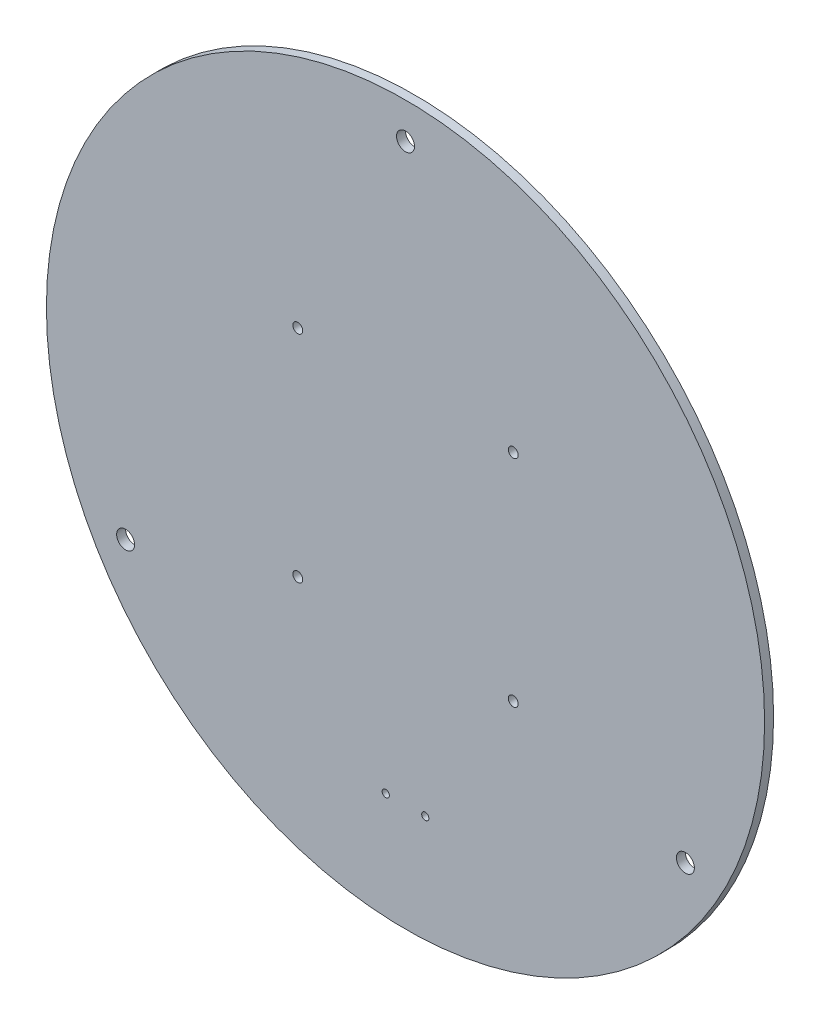
ISO-10303-21;
HEADER;
FILE_DESCRIPTION(('STEP AP214'),'2;1');
FILE_NAME('part.step','',(''),(''),'','','');
FILE_SCHEMA(('AUTOMOTIVE_DESIGN { 1 0 10303 214 1 1 1 1 }'));
ENDSEC;
DATA;
#1=APPLICATION_CONTEXT('core data for automotive mechanical design processes');
#2=APPLICATION_PROTOCOL_DEFINITION('international standard','automotive_design',2000,#1);
#3=PRODUCT_CONTEXT('',#1,'mechanical');
#4=PRODUCT('Part','Part','',(#3));
#5=PRODUCT_RELATED_PRODUCT_CATEGORY('part','',(#4));
#6=PRODUCT_DEFINITION_FORMATION('','',#4);
#7=PRODUCT_DEFINITION_CONTEXT('part definition',#1,'design');
#8=PRODUCT_DEFINITION('design','',#6,#7);
#9=PRODUCT_DEFINITION_SHAPE('','',#8);
#10=(LENGTH_UNIT() NAMED_UNIT(*) SI_UNIT(.MILLI.,.METRE.));
#11=(NAMED_UNIT(*) PLANE_ANGLE_UNIT() SI_UNIT($,.RADIAN.));
#12=(NAMED_UNIT(*) SI_UNIT($,.STERADIAN.) SOLID_ANGLE_UNIT());
#13=UNCERTAINTY_MEASURE_WITH_UNIT(LENGTH_MEASURE(1.E-05),#10,'distance_accuracy_value','');
#14=(GEOMETRIC_REPRESENTATION_CONTEXT(3) GLOBAL_UNCERTAINTY_ASSIGNED_CONTEXT((#13)) GLOBAL_UNIT_ASSIGNED_CONTEXT((#10,
#11,#12)) REPRESENTATION_CONTEXT('',''));
#15=CARTESIAN_POINT('',(0.,0.,0.));
#16=DIRECTION('',(0.,0.,1.));
#17=DIRECTION('',(1.,0.,0.));
#18=AXIS2_PLACEMENT_3D('',#15,#16,#17);
#19=CARTESIAN_POINT('',(0.,0.,5.));
#20=DIRECTION('',(0.,0.,-1.));
#21=DIRECTION('',(-1.,0.,0.));
#22=AXIS2_PLACEMENT_3D('',#19,#20,#21);
#23=CYLINDRICAL_SURFACE('',#22,200.);
#24=CARTESIAN_POINT('',(0.,0.,5.));
#25=DIRECTION('',(0.,0.,1.));
#26=DIRECTION('',(1.,0.,0.));
#27=AXIS2_PLACEMENT_3D('',#24,#25,#26);
#28=CIRCLE('',#27,200.);
#29=CARTESIAN_POINT('',(200.,0.,5.));
#30=VERTEX_POINT('',#29);
#31=EDGE_CURVE('E10',#30,#30,#28,.T.);
#32=ORIENTED_EDGE('',*,*,#31,.F.);
#33=EDGE_LOOP('',(#32));
#34=FACE_BOUND('',#33,.T.);
#35=CARTESIAN_POINT('',(0.,0.,0.));
#36=DIRECTION('',(0.,0.,1.));
#37=DIRECTION('',(1.,0.,0.));
#38=AXIS2_PLACEMENT_3D('',#35,#36,#37);
#39=CIRCLE('',#38,200.);
#40=CARTESIAN_POINT('',(200.,0.,0.));
#41=VERTEX_POINT('',#40);
#42=EDGE_CURVE('E37',#41,#41,#39,.T.);
#43=ORIENTED_EDGE('',*,*,#42,.T.);
#44=EDGE_LOOP('',(#43));
#45=FACE_BOUND('',#44,.T.);
#46=ADVANCED_FACE('F34',(#34,#45),#23,.T.);
#47=CARTESIAN_POINT('',(0.,0.,5.));
#48=DIRECTION('',(0.,0.,1.));
#49=DIRECTION('',(1.,0.,0.));
#50=AXIS2_PLACEMENT_3D('',#47,#48,#49);
#51=PLANE('',#50);
#52=CARTESIAN_POINT('',(11.,-140.,5.));
#53=DIRECTION('',(0.,0.,1.));
#54=DIRECTION('',(1.,0.,0.));
#55=AXIS2_PLACEMENT_3D('',#52,#53,#54);
#56=CIRCLE('',#55,2.);
#57=CARTESIAN_POINT('',(13.,-140.,5.));
#58=VERTEX_POINT('',#57);
#59=EDGE_CURVE('E91',#58,#58,#56,.T.);
#60=ORIENTED_EDGE('',*,*,#59,.F.);
#61=EDGE_LOOP('',(#60));
#62=FACE_BOUND('',#61,.T.);
#63=CARTESIAN_POINT('',(-11.,-140.,5.));
#64=DIRECTION('',(0.,0.,1.));
#65=DIRECTION('',(1.,0.,0.));
#66=AXIS2_PLACEMENT_3D('',#63,#64,#65);
#67=CIRCLE('',#66,2.);
#68=CARTESIAN_POINT('',(-8.99999999999998,-140.,5.));
#69=VERTEX_POINT('',#68);
#70=EDGE_CURVE('E92',#69,#69,#67,.T.);
#71=ORIENTED_EDGE('',*,*,#70,.F.);
#72=EDGE_LOOP('',(#71));
#73=FACE_BOUND('',#72,.T.);
#74=CARTESIAN_POINT('',(-60.,-60.,5.));
#75=DIRECTION('',(0.,0.,1.));
#76=DIRECTION('',(1.,0.,0.));
#77=AXIS2_PLACEMENT_3D('',#74,#75,#76);
#78=CIRCLE('',#77,2.75);
#79=CARTESIAN_POINT('',(-57.25,-60.,5.));
#80=VERTEX_POINT('',#79);
#81=EDGE_CURVE('E74',#80,#80,#78,.T.);
#82=ORIENTED_EDGE('',*,*,#81,.F.);
#83=EDGE_LOOP('',(#82));
#84=FACE_BOUND('',#83,.T.);
#85=CARTESIAN_POINT('',(60.,-60.,5.));
#86=DIRECTION('',(0.,0.,1.));
#87=DIRECTION('',(1.,0.,0.));
#88=AXIS2_PLACEMENT_3D('',#85,#86,#87);
#89=CIRCLE('',#88,2.75);
#90=CARTESIAN_POINT('',(62.75,-60.,5.));
#91=VERTEX_POINT('',#90);
#92=EDGE_CURVE('E73',#91,#91,#89,.T.);
#93=ORIENTED_EDGE('',*,*,#92,.F.);
#94=EDGE_LOOP('',(#93));
#95=FACE_BOUND('',#94,.T.);
#96=CARTESIAN_POINT('',(60.,60.,5.));
#97=DIRECTION('',(0.,0.,1.));
#98=DIRECTION('',(1.,0.,0.));
#99=AXIS2_PLACEMENT_3D('',#96,#97,#98);
#100=CIRCLE('',#99,2.75);
#101=CARTESIAN_POINT('',(62.75,60.,5.));
#102=VERTEX_POINT('',#101);
#103=EDGE_CURVE('E81',#102,#102,#100,.T.);
#104=ORIENTED_EDGE('',*,*,#103,.F.);
#105=EDGE_LOOP('',(#104));
#106=FACE_BOUND('',#105,.T.);
#107=CARTESIAN_POINT('',(-60.,60.,5.));
#108=DIRECTION('',(0.,0.,1.));
#109=DIRECTION('',(1.,0.,0.));
#110=AXIS2_PLACEMENT_3D('',#107,#108,#109);
#111=CIRCLE('',#110,2.75);
#112=CARTESIAN_POINT('',(-57.25,60.,5.));
#113=VERTEX_POINT('',#112);
#114=EDGE_CURVE('E66',#113,#113,#111,.T.);
#115=ORIENTED_EDGE('',*,*,#114,.F.);
#116=EDGE_LOOP('',(#115));
#117=FACE_BOUND('',#116,.T.);
#118=CARTESIAN_POINT('',(0.,180.,5.));
#119=DIRECTION('',(0.,0.,1.));
#120=DIRECTION('',(1.,0.,0.));
#121=AXIS2_PLACEMENT_3D('',#118,#119,#120);
#122=CIRCLE('',#121,5.);
#123=CARTESIAN_POINT('',(5.,180.,5.));
#124=VERTEX_POINT('',#123);
#125=EDGE_CURVE('E57',#124,#124,#122,.T.);
#126=ORIENTED_EDGE('',*,*,#125,.F.);
#127=EDGE_LOOP('',(#126));
#128=FACE_BOUND('',#127,.T.);
#129=CARTESIAN_POINT('',(155.884572681199,-90.0000000000007,5.));
#130=DIRECTION('',(0.,0.,1.));
#131=DIRECTION('',(1.,0.,0.));
#132=AXIS2_PLACEMENT_3D('',#129,#130,#131);
#133=CIRCLE('',#132,5.00000000000002);
#134=CARTESIAN_POINT('',(160.884572681199,-90.0000000000007,5.));
#135=VERTEX_POINT('',#134);
#136=EDGE_CURVE('E49',#135,#135,#133,.T.);
#137=ORIENTED_EDGE('',*,*,#136,.F.);
#138=EDGE_LOOP('',(#137));
#139=FACE_BOUND('',#138,.T.);
#140=CARTESIAN_POINT('',(-155.884572681199,-90.0000000000008,5.));
#141=DIRECTION('',(0.,0.,1.));
#142=DIRECTION('',(1.,0.,0.));
#143=AXIS2_PLACEMENT_3D('',#140,#141,#142);
#144=CIRCLE('',#143,5.00000000000002);
#145=CARTESIAN_POINT('',(-150.884572681198,-90.0000000000008,5.));
#146=VERTEX_POINT('',#145);
#147=EDGE_CURVE('E50',#146,#146,#144,.T.);
#148=ORIENTED_EDGE('',*,*,#147,.F.);
#149=EDGE_LOOP('',(#148));
#150=FACE_BOUND('',#149,.T.);
#151=ORIENTED_EDGE('',*,*,#31,.T.);
#152=EDGE_LOOP('',(#151));
#153=FACE_BOUND('',#152,.T.);
#154=ADVANCED_FACE('F103',(#62,#73,#84,#95,#106,#117,#128,#139,#150,#153),#51,.T.);
#155=CARTESIAN_POINT('',(0.,0.,0.));
#156=DIRECTION('',(0.,0.,1.));
#157=DIRECTION('',(1.,0.,0.));
#158=AXIS2_PLACEMENT_3D('',#155,#156,#157);
#159=PLANE('',#158);
#160=CARTESIAN_POINT('',(11.,-140.,0.));
#161=DIRECTION('',(0.,0.,1.));
#162=DIRECTION('',(1.,0.,0.));
#163=AXIS2_PLACEMENT_3D('',#160,#161,#162);
#164=CIRCLE('',#163,2.);
#165=CARTESIAN_POINT('',(13.,-140.,0.));
#166=VERTEX_POINT('',#165);
#167=EDGE_CURVE('E77',#166,#166,#164,.F.);
#168=ORIENTED_EDGE('',*,*,#167,.F.);
#169=EDGE_LOOP('',(#168));
#170=FACE_BOUND('',#169,.T.);
#171=CARTESIAN_POINT('',(-11.,-140.,0.));
#172=DIRECTION('',(0.,0.,1.));
#173=DIRECTION('',(1.,0.,0.));
#174=AXIS2_PLACEMENT_3D('',#171,#172,#173);
#175=CIRCLE('',#174,2.);
#176=CARTESIAN_POINT('',(-8.99999999999998,-140.,0.));
#177=VERTEX_POINT('',#176);
#178=EDGE_CURVE('E88',#177,#177,#175,.F.);
#179=ORIENTED_EDGE('',*,*,#178,.F.);
#180=EDGE_LOOP('',(#179));
#181=FACE_BOUND('',#180,.T.);
#182=CARTESIAN_POINT('',(-60.,-60.,0.));
#183=DIRECTION('',(0.,0.,1.));
#184=DIRECTION('',(1.,0.,0.));
#185=AXIS2_PLACEMENT_3D('',#182,#183,#184);
#186=CIRCLE('',#185,2.75);
#187=CARTESIAN_POINT('',(-57.25,-60.,0.));
#188=VERTEX_POINT('',#187);
#189=EDGE_CURVE('E70',#188,#188,#186,.F.);
#190=ORIENTED_EDGE('',*,*,#189,.F.);
#191=EDGE_LOOP('',(#190));
#192=FACE_BOUND('',#191,.T.);
#193=CARTESIAN_POINT('',(60.,-60.,0.));
#194=DIRECTION('',(0.,0.,1.));
#195=DIRECTION('',(1.,0.,0.));
#196=AXIS2_PLACEMENT_3D('',#193,#194,#195);
#197=CIRCLE('',#196,2.75);
#198=CARTESIAN_POINT('',(62.75,-60.,0.));
#199=VERTEX_POINT('',#198);
#200=EDGE_CURVE('E78',#199,#199,#197,.F.);
#201=ORIENTED_EDGE('',*,*,#200,.F.);
#202=EDGE_LOOP('',(#201));
#203=FACE_BOUND('',#202,.T.);
#204=CARTESIAN_POINT('',(60.,60.,0.));
#205=DIRECTION('',(0.,0.,1.));
#206=DIRECTION('',(1.,0.,0.));
#207=AXIS2_PLACEMENT_3D('',#204,#205,#206);
#208=CIRCLE('',#207,2.75);
#209=CARTESIAN_POINT('',(62.75,60.,0.));
#210=VERTEX_POINT('',#209);
#211=EDGE_CURVE('E69',#210,#210,#208,.F.);
#212=ORIENTED_EDGE('',*,*,#211,.F.);
#213=EDGE_LOOP('',(#212));
#214=FACE_BOUND('',#213,.T.);
#215=CARTESIAN_POINT('',(-60.,60.,0.));
#216=DIRECTION('',(0.,0.,1.));
#217=DIRECTION('',(1.,0.,0.));
#218=AXIS2_PLACEMENT_3D('',#215,#216,#217);
#219=CIRCLE('',#218,2.75);
#220=CARTESIAN_POINT('',(-57.25,60.,0.));
#221=VERTEX_POINT('',#220);
#222=EDGE_CURVE('E53',#221,#221,#219,.F.);
#223=ORIENTED_EDGE('',*,*,#222,.F.);
#224=EDGE_LOOP('',(#223));
#225=FACE_BOUND('',#224,.T.);
#226=CARTESIAN_POINT('',(0.,180.,0.));
#227=DIRECTION('',(0.,0.,1.));
#228=DIRECTION('',(1.,0.,0.));
#229=AXIS2_PLACEMENT_3D('',#226,#227,#228);
#230=CIRCLE('',#229,5.);
#231=CARTESIAN_POINT('',(5.,180.,0.));
#232=VERTEX_POINT('',#231);
#233=EDGE_CURVE('E44',#232,#232,#230,.F.);
#234=ORIENTED_EDGE('',*,*,#233,.F.);
#235=EDGE_LOOP('',(#234));
#236=FACE_BOUND('',#235,.T.);
#237=CARTESIAN_POINT('',(155.884572681199,-90.0000000000007,0.));
#238=DIRECTION('',(0.,0.,1.));
#239=DIRECTION('',(1.,0.,0.));
#240=AXIS2_PLACEMENT_3D('',#237,#238,#239);
#241=CIRCLE('',#240,5.00000000000002);
#242=CARTESIAN_POINT('',(160.884572681199,-90.0000000000007,0.));
#243=VERTEX_POINT('',#242);
#244=EDGE_CURVE('E54',#243,#243,#241,.F.);
#245=ORIENTED_EDGE('',*,*,#244,.F.);
#246=EDGE_LOOP('',(#245));
#247=FACE_BOUND('',#246,.T.);
#248=CARTESIAN_POINT('',(-155.884572681199,-90.0000000000008,0.));
#249=DIRECTION('',(0.,0.,1.));
#250=DIRECTION('',(1.,0.,0.));
#251=AXIS2_PLACEMENT_3D('',#248,#249,#250);
#252=CIRCLE('',#251,5.00000000000002);
#253=CARTESIAN_POINT('',(-150.884572681198,-90.0000000000008,0.));
#254=VERTEX_POINT('',#253);
#255=EDGE_CURVE('E46',#254,#254,#252,.F.);
#256=ORIENTED_EDGE('',*,*,#255,.F.);
#257=EDGE_LOOP('',(#256));
#258=FACE_BOUND('',#257,.T.);
#259=ORIENTED_EDGE('',*,*,#42,.F.);
#260=EDGE_LOOP('',(#259));
#261=FACE_BOUND('',#260,.T.);
#262=ADVANCED_FACE('F106',(#170,#181,#192,#203,#214,#225,#236,#247,#258,#261),#159,.F.);
#263=CARTESIAN_POINT('',(-155.884572681199,-90.0000000000008,-0.00100000000000013));
#264=DIRECTION('',(0.,0.,1.));
#265=DIRECTION('',(1.,0.,0.));
#266=AXIS2_PLACEMENT_3D('',#263,#264,#265);
#267=CYLINDRICAL_SURFACE('',#266,5.00000000000002);
#268=ORIENTED_EDGE('',*,*,#147,.T.);
#269=EDGE_LOOP('',(#268));
#270=FACE_BOUND('',#269,.T.);
#271=ORIENTED_EDGE('',*,*,#255,.T.);
#272=EDGE_LOOP('',(#271));
#273=FACE_BOUND('',#272,.T.);
#274=ADVANCED_FACE('F124',(#270,#273),#267,.F.);
#275=CARTESIAN_POINT('',(155.884572681199,-90.0000000000007,-0.00100000000000013));
#276=DIRECTION('',(0.,0.,1.));
#277=DIRECTION('',(1.,0.,0.));
#278=AXIS2_PLACEMENT_3D('',#275,#276,#277);
#279=CYLINDRICAL_SURFACE('',#278,5.00000000000002);
#280=ORIENTED_EDGE('',*,*,#136,.T.);
#281=EDGE_LOOP('',(#280));
#282=FACE_BOUND('',#281,.T.);
#283=ORIENTED_EDGE('',*,*,#244,.T.);
#284=EDGE_LOOP('',(#283));
#285=FACE_BOUND('',#284,.T.);
#286=ADVANCED_FACE('F127',(#282,#285),#279,.F.);
#287=CARTESIAN_POINT('',(0.,180.,-0.00100000000000013));
#288=DIRECTION('',(0.,0.,1.));
#289=DIRECTION('',(1.,0.,0.));
#290=AXIS2_PLACEMENT_3D('',#287,#288,#289);
#291=CYLINDRICAL_SURFACE('',#290,5.);
#292=ORIENTED_EDGE('',*,*,#125,.T.);
#293=EDGE_LOOP('',(#292));
#294=FACE_BOUND('',#293,.T.);
#295=ORIENTED_EDGE('',*,*,#233,.T.);
#296=EDGE_LOOP('',(#295));
#297=FACE_BOUND('',#296,.T.);
#298=ADVANCED_FACE('F160',(#294,#297),#291,.F.);
#299=CARTESIAN_POINT('',(-60.,60.,-0.00100000000000013));
#300=DIRECTION('',(0.,0.,1.));
#301=DIRECTION('',(1.,0.,0.));
#302=AXIS2_PLACEMENT_3D('',#299,#300,#301);
#303=CYLINDRICAL_SURFACE('',#302,2.75);
#304=ORIENTED_EDGE('',*,*,#114,.T.);
#305=EDGE_LOOP('',(#304));
#306=FACE_BOUND('',#305,.T.);
#307=ORIENTED_EDGE('',*,*,#222,.T.);
#308=EDGE_LOOP('',(#307));
#309=FACE_BOUND('',#308,.T.);
#310=ADVANCED_FACE('F168',(#306,#309),#303,.F.);
#311=CARTESIAN_POINT('',(60.,60.,-0.00100000000000013));
#312=DIRECTION('',(0.,0.,1.));
#313=DIRECTION('',(1.,0.,0.));
#314=AXIS2_PLACEMENT_3D('',#311,#312,#313);
#315=CYLINDRICAL_SURFACE('',#314,2.75);
#316=ORIENTED_EDGE('',*,*,#103,.T.);
#317=EDGE_LOOP('',(#316));
#318=FACE_BOUND('',#317,.T.);
#319=ORIENTED_EDGE('',*,*,#211,.T.);
#320=EDGE_LOOP('',(#319));
#321=FACE_BOUND('',#320,.T.);
#322=ADVANCED_FACE('F176',(#318,#321),#315,.F.);
#323=CARTESIAN_POINT('',(60.,-60.,-0.00100000000000013));
#324=DIRECTION('',(0.,0.,1.));
#325=DIRECTION('',(1.,0.,0.));
#326=AXIS2_PLACEMENT_3D('',#323,#324,#325);
#327=CYLINDRICAL_SURFACE('',#326,2.75);
#328=ORIENTED_EDGE('',*,*,#92,.T.);
#329=EDGE_LOOP('',(#328));
#330=FACE_BOUND('',#329,.T.);
#331=ORIENTED_EDGE('',*,*,#200,.T.);
#332=EDGE_LOOP('',(#331));
#333=FACE_BOUND('',#332,.T.);
#334=ADVANCED_FACE('F184',(#330,#333),#327,.F.);
#335=CARTESIAN_POINT('',(-60.,-60.,-0.00100000000000013));
#336=DIRECTION('',(0.,0.,1.));
#337=DIRECTION('',(1.,0.,0.));
#338=AXIS2_PLACEMENT_3D('',#335,#336,#337);
#339=CYLINDRICAL_SURFACE('',#338,2.75);
#340=ORIENTED_EDGE('',*,*,#81,.T.);
#341=EDGE_LOOP('',(#340));
#342=FACE_BOUND('',#341,.T.);
#343=ORIENTED_EDGE('',*,*,#189,.T.);
#344=EDGE_LOOP('',(#343));
#345=FACE_BOUND('',#344,.T.);
#346=ADVANCED_FACE('F192',(#342,#345),#339,.F.);
#347=CARTESIAN_POINT('',(-11.,-140.,-0.00100000000000013));
#348=DIRECTION('',(0.,0.,1.));
#349=DIRECTION('',(1.,0.,0.));
#350=AXIS2_PLACEMENT_3D('',#347,#348,#349);
#351=CYLINDRICAL_SURFACE('',#350,2.);
#352=ORIENTED_EDGE('',*,*,#70,.T.);
#353=EDGE_LOOP('',(#352));
#354=FACE_BOUND('',#353,.T.);
#355=ORIENTED_EDGE('',*,*,#178,.T.);
#356=EDGE_LOOP('',(#355));
#357=FACE_BOUND('',#356,.T.);
#358=ADVANCED_FACE('F199',(#354,#357),#351,.F.);
#359=CARTESIAN_POINT('',(11.,-140.,-0.00100000000000013));
#360=DIRECTION('',(0.,0.,1.));
#361=DIRECTION('',(1.,0.,0.));
#362=AXIS2_PLACEMENT_3D('',#359,#360,#361);
#363=CYLINDRICAL_SURFACE('',#362,2.);
#364=ORIENTED_EDGE('',*,*,#59,.T.);
#365=EDGE_LOOP('',(#364));
#366=FACE_BOUND('',#365,.T.);
#367=ORIENTED_EDGE('',*,*,#167,.T.);
#368=EDGE_LOOP('',(#367));
#369=FACE_BOUND('',#368,.T.);
#370=ADVANCED_FACE('F100',(#366,#369),#363,.F.);
#371=CLOSED_SHELL('',(#46,#154,#262,#274,#286,#298,#310,#322,#334,#346,#358,#370));
#372=MANIFOLD_SOLID_BREP('B2',#371);
#373=ADVANCED_BREP_SHAPE_REPRESENTATION('',(#18,#372),#14);
#374=SHAPE_DEFINITION_REPRESENTATION(#9,#373);
ENDSEC;
END-ISO-10303-21;
